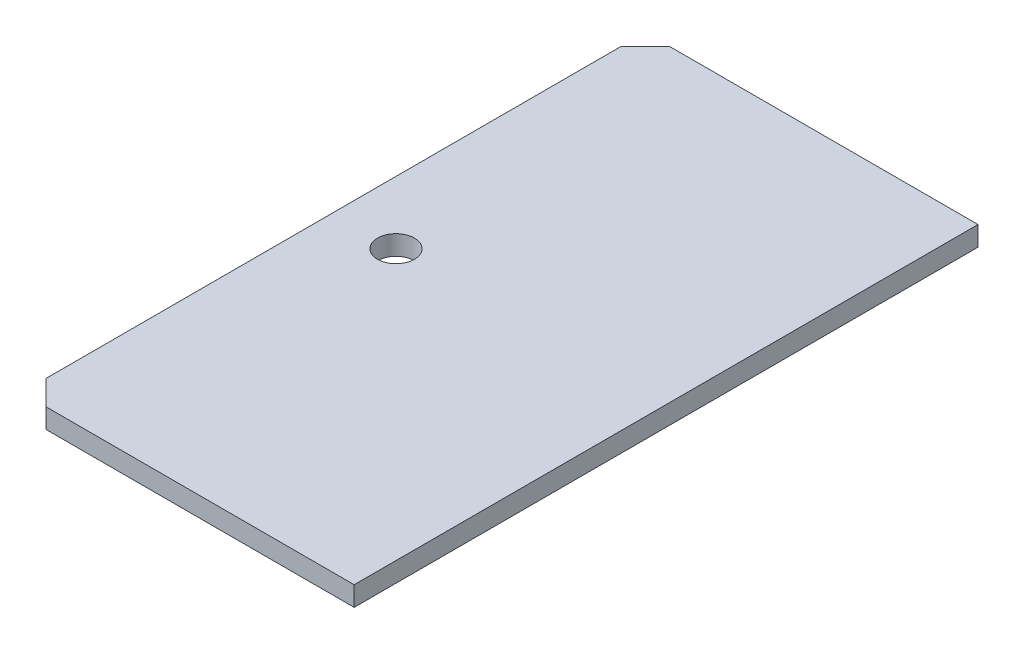
ISO-10303-21;
HEADER;
FILE_DESCRIPTION(('STEP AP214'),'2;1');
FILE_NAME('part.step','',(''),(''),'','','');
FILE_SCHEMA(('AUTOMOTIVE_DESIGN { 1 0 10303 214 1 1 1 1 }'));
ENDSEC;
DATA;
#1=APPLICATION_CONTEXT('core data for automotive mechanical design processes');
#2=APPLICATION_PROTOCOL_DEFINITION('international standard','automotive_design',2000,#1);
#3=PRODUCT_CONTEXT('',#1,'mechanical');
#4=PRODUCT('Part','Part','',(#3));
#5=PRODUCT_RELATED_PRODUCT_CATEGORY('part','',(#4));
#6=PRODUCT_DEFINITION_FORMATION('','',#4);
#7=PRODUCT_DEFINITION_CONTEXT('part definition',#1,'design');
#8=PRODUCT_DEFINITION('design','',#6,#7);
#9=PRODUCT_DEFINITION_SHAPE('','',#8);
#10=(LENGTH_UNIT() NAMED_UNIT(*) SI_UNIT(.MILLI.,.METRE.));
#11=(NAMED_UNIT(*) PLANE_ANGLE_UNIT() SI_UNIT($,.RADIAN.));
#12=(NAMED_UNIT(*) SI_UNIT($,.STERADIAN.) SOLID_ANGLE_UNIT());
#13=UNCERTAINTY_MEASURE_WITH_UNIT(LENGTH_MEASURE(1.E-05),#10,'distance_accuracy_value','');
#14=(GEOMETRIC_REPRESENTATION_CONTEXT(3) GLOBAL_UNCERTAINTY_ASSIGNED_CONTEXT((#13)) GLOBAL_UNIT_ASSIGNED_CONTEXT((#10,
#11,#12)) REPRESENTATION_CONTEXT('',''));
#15=CARTESIAN_POINT('',(0.,0.,0.));
#16=DIRECTION('',(0.,0.,1.));
#17=DIRECTION('',(1.,0.,0.));
#18=AXIS2_PLACEMENT_3D('',#15,#16,#17);
#19=CARTESIAN_POINT('',(-40.64,1.6002,-25.4));
#20=DIRECTION('',(0.,0.,1.));
#21=DIRECTION('',(1.,0.,0.));
#22=AXIS2_PLACEMENT_3D('',#19,#20,#21);
#23=PLANE('',#22);
#24=DIRECTION('',(-1.,0.,0.));
#25=VECTOR('',#24,1.);
#26=CARTESIAN_POINT('',(-40.64,1.6002,-25.4));
#27=LINE('',#26,#25);
#28=CARTESIAN_POINT('',(-13.5466666666667,1.6002,-25.4));
#29=VERTEX_POINT('',#28);
#30=CARTESIAN_POINT('',(-38.64,1.6002,-25.4));
#31=VERTEX_POINT('',#30);
#32=EDGE_CURVE('E112',#29,#31,#27,.T.);
#33=ORIENTED_EDGE('',*,*,#32,.F.);
#34=DIRECTION('',(0.,-1.,0.));
#35=VECTOR('',#34,1.);
#36=CARTESIAN_POINT('',(-13.5466666666667,10.,-25.4));
#37=LINE('',#36,#35);
#38=CARTESIAN_POINT('',(-13.5466666666667,0.,-25.4));
#39=VERTEX_POINT('',#38);
#40=EDGE_CURVE('E100',#29,#39,#37,.T.);
#41=ORIENTED_EDGE('',*,*,#40,.T.);
#42=DIRECTION('',(-1.,0.,0.));
#43=VECTOR('',#42,1.);
#44=CARTESIAN_POINT('',(-40.64,0.,-25.4));
#45=LINE('',#44,#43);
#46=CARTESIAN_POINT('',(-38.64,0.,-25.4));
#47=VERTEX_POINT('',#46);
#48=EDGE_CURVE('E110',#39,#47,#45,.T.);
#49=ORIENTED_EDGE('',*,*,#48,.T.);
#50=DIRECTION('',(0.,1.,0.));
#51=VECTOR('',#50,1.);
#52=CARTESIAN_POINT('',(-38.64,1.6002,-25.4));
#53=LINE('',#52,#51);
#54=EDGE_CURVE('E11',#47,#31,#53,.T.);
#55=ORIENTED_EDGE('',*,*,#54,.T.);
#56=EDGE_LOOP('',(#33,#41,#49,#55));
#57=FACE_BOUND('',#56,.T.);
#58=ADVANCED_FACE('F44',(#57),#23,.F.);
#59=CARTESIAN_POINT('',(-40.64,1.6002,-25.4));
#60=DIRECTION('',(1.,0.,0.));
#61=DIRECTION('',(0.,0.,-1.));
#62=AXIS2_PLACEMENT_3D('',#59,#60,#61);
#63=PLANE('',#62);
#64=DIRECTION('',(0.,0.,1.));
#65=VECTOR('',#64,1.);
#66=CARTESIAN_POINT('',(-40.64,0.,-25.4));
#67=LINE('',#66,#65);
#68=CARTESIAN_POINT('',(-40.64,0.,-23.4));
#69=VERTEX_POINT('',#68);
#70=CARTESIAN_POINT('',(-40.64,0.,23.4));
#71=VERTEX_POINT('',#70);
#72=EDGE_CURVE('E121',#69,#71,#67,.T.);
#73=ORIENTED_EDGE('',*,*,#72,.T.);
#74=DIRECTION('',(0.,1.,0.));
#75=VECTOR('',#74,1.);
#76=CARTESIAN_POINT('',(-40.64,1.6002,23.4));
#77=LINE('',#76,#75);
#78=CARTESIAN_POINT('',(-40.64,1.6002,23.4));
#79=VERTEX_POINT('',#78);
#80=EDGE_CURVE('E54',#71,#79,#77,.T.);
#81=ORIENTED_EDGE('',*,*,#80,.T.);
#82=DIRECTION('',(0.,0.,1.));
#83=VECTOR('',#82,1.);
#84=CARTESIAN_POINT('',(-40.64,1.6002,-25.4));
#85=LINE('',#84,#83);
#86=CARTESIAN_POINT('',(-40.64,1.6002,-23.4));
#87=VERTEX_POINT('',#86);
#88=EDGE_CURVE('E159',#87,#79,#85,.T.);
#89=ORIENTED_EDGE('',*,*,#88,.F.);
#90=DIRECTION('',(0.,-1.,0.));
#91=VECTOR('',#90,1.);
#92=CARTESIAN_POINT('',(-40.64,1.6002,-23.4));
#93=LINE('',#92,#91);
#94=EDGE_CURVE('E152',#87,#69,#93,.T.);
#95=ORIENTED_EDGE('',*,*,#94,.T.);
#96=EDGE_LOOP('',(#73,#81,#89,#95));
#97=FACE_BOUND('',#96,.T.);
#98=ADVANCED_FACE('F179',(#97),#63,.F.);
#99=CARTESIAN_POINT('',(-40.64,1.6002,25.4));
#100=DIRECTION('',(0.,0.,-1.));
#101=DIRECTION('',(-1.,0.,0.));
#102=AXIS2_PLACEMENT_3D('',#99,#100,#101);
#103=PLANE('',#102);
#104=DIRECTION('',(1.,0.,0.));
#105=VECTOR('',#104,1.);
#106=CARTESIAN_POINT('',(-40.64,0.,25.4));
#107=LINE('',#106,#105);
#108=CARTESIAN_POINT('',(-38.64,0.,25.4));
#109=VERTEX_POINT('',#108);
#110=CARTESIAN_POINT('',(-13.5466666666667,0.,25.4));
#111=VERTEX_POINT('',#110);
#112=EDGE_CURVE('E126',#109,#111,#107,.T.);
#113=ORIENTED_EDGE('',*,*,#112,.T.);
#114=DIRECTION('',(0.,-1.,0.));
#115=VECTOR('',#114,1.);
#116=CARTESIAN_POINT('',(-13.5466666666667,10.,25.4));
#117=LINE('',#116,#115);
#118=CARTESIAN_POINT('',(-13.5466666666667,1.6002,25.4));
#119=VERTEX_POINT('',#118);
#120=EDGE_CURVE('E61',#119,#111,#117,.T.);
#121=ORIENTED_EDGE('',*,*,#120,.F.);
#122=DIRECTION('',(1.,0.,0.));
#123=VECTOR('',#122,1.);
#124=CARTESIAN_POINT('',(-40.64,1.6002,25.4));
#125=LINE('',#124,#123);
#126=CARTESIAN_POINT('',(-38.64,1.6002,25.4));
#127=VERTEX_POINT('',#126);
#128=EDGE_CURVE('E132',#127,#119,#125,.T.);
#129=ORIENTED_EDGE('',*,*,#128,.F.);
#130=DIRECTION('',(0.,-1.,0.));
#131=VECTOR('',#130,1.);
#132=CARTESIAN_POINT('',(-38.64,1.6002,25.4));
#133=LINE('',#132,#131);
#134=EDGE_CURVE('E142',#127,#109,#133,.T.);
#135=ORIENTED_EDGE('',*,*,#134,.T.);
#136=EDGE_LOOP('',(#113,#121,#129,#135));
#137=FACE_BOUND('',#136,.T.);
#138=ADVANCED_FACE('F172',(#137),#103,.F.);
#139=CARTESIAN_POINT('',(0.,1.6002,0.));
#140=DIRECTION('',(0.,1.,0.));
#141=DIRECTION('',(0.,0.,1.));
#142=AXIS2_PLACEMENT_3D('',#139,#140,#141);
#143=PLANE('',#142);
#144=DIRECTION('',(0.,0.,1.));
#145=VECTOR('',#144,1.);
#146=CARTESIAN_POINT('',(-13.5466666666667,1.6002,0.));
#147=LINE('',#146,#145);
#148=EDGE_CURVE('E114',#29,#119,#147,.T.);
#149=ORIENTED_EDGE('',*,*,#148,.F.);
#150=ORIENTED_EDGE('',*,*,#32,.T.);
#151=DIRECTION('',(0.707106781186548,0.,-0.707106781186548));
#152=VECTOR('',#151,1.);
#153=CARTESIAN_POINT('',(-32.02,1.6002,-32.02));
#154=LINE('',#153,#152);
#155=EDGE_CURVE('E146',#31,#87,#154,.F.);
#156=ORIENTED_EDGE('',*,*,#155,.T.);
#157=ORIENTED_EDGE('',*,*,#88,.T.);
#158=DIRECTION('',(-0.707106781186545,0.,-0.70710678118655));
#159=VECTOR('',#158,1.);
#160=CARTESIAN_POINT('',(-32.0200000000001,1.6002,32.0199999999999));
#161=LINE('',#160,#159);
#162=EDGE_CURVE('E149',#79,#127,#161,.F.);
#163=ORIENTED_EDGE('',*,*,#162,.T.);
#164=ORIENTED_EDGE('',*,*,#128,.T.);
#165=EDGE_LOOP('',(#149,#150,#156,#157,#163,#164));
#166=FACE_BOUND('',#165,.T.);
#167=CARTESIAN_POINT('',(-35.54,1.6002,0.));
#168=DIRECTION('',(0.,1.,0.));
#169=DIRECTION('',(0.,0.,1.));
#170=AXIS2_PLACEMENT_3D('',#167,#168,#169);
#171=CIRCLE('',#170,1.5);
#172=CARTESIAN_POINT('',(-35.54,1.6002,1.5));
#173=VERTEX_POINT('',#172);
#174=EDGE_CURVE('E129',#173,#173,#171,.T.);
#175=ORIENTED_EDGE('',*,*,#174,.F.);
#176=EDGE_LOOP('',(#175));
#177=FACE_BOUND('',#176,.T.);
#178=ADVANCED_FACE('F174',(#166,#177),#143,.T.);
#179=CARTESIAN_POINT('',(0.,0.,0.));
#180=DIRECTION('',(0.,1.,0.));
#181=DIRECTION('',(0.,0.,1.));
#182=AXIS2_PLACEMENT_3D('',#179,#180,#181);
#183=PLANE('',#182);
#184=CARTESIAN_POINT('',(-35.54,0.,0.));
#185=DIRECTION('',(0.,1.,0.));
#186=DIRECTION('',(0.,0.,1.));
#187=AXIS2_PLACEMENT_3D('',#184,#185,#186);
#188=CIRCLE('',#187,1.5);
#189=CARTESIAN_POINT('',(-35.54,0.,1.5));
#190=VERTEX_POINT('',#189);
#191=EDGE_CURVE('E122',#190,#190,#188,.T.);
#192=ORIENTED_EDGE('',*,*,#191,.T.);
#193=EDGE_LOOP('',(#192));
#194=FACE_BOUND('',#193,.T.);
#195=ORIENTED_EDGE('',*,*,#48,.F.);
#196=DIRECTION('',(0.,0.,-1.));
#197=VECTOR('',#196,1.);
#198=CARTESIAN_POINT('',(-13.5466666666667,0.,25.4));
#199=LINE('',#198,#197);
#200=EDGE_CURVE('E97',#111,#39,#199,.T.);
#201=ORIENTED_EDGE('',*,*,#200,.F.);
#202=ORIENTED_EDGE('',*,*,#112,.F.);
#203=DIRECTION('',(0.707106781186545,0.,0.70710678118655));
#204=VECTOR('',#203,1.);
#205=CARTESIAN_POINT('',(-38.64,0.,25.4));
#206=LINE('',#205,#204);
#207=EDGE_CURVE('E139',#109,#71,#206,.F.);
#208=ORIENTED_EDGE('',*,*,#207,.T.);
#209=ORIENTED_EDGE('',*,*,#72,.F.);
#210=DIRECTION('',(-0.707106781186548,0.,0.707106781186548));
#211=VECTOR('',#210,1.);
#212=CARTESIAN_POINT('',(-40.64,0.,-23.4));
#213=LINE('',#212,#211);
#214=EDGE_CURVE('E118',#69,#47,#213,.F.);
#215=ORIENTED_EDGE('',*,*,#214,.T.);
#216=EDGE_LOOP('',(#195,#201,#202,#208,#209,#215));
#217=FACE_BOUND('',#216,.T.);
#218=ADVANCED_FACE('F116',(#194,#217),#183,.F.);
#219=CARTESIAN_POINT('',(-35.54,0.,0.));
#220=DIRECTION('',(0.,1.,0.));
#221=DIRECTION('',(0.,0.,1.));
#222=AXIS2_PLACEMENT_3D('',#219,#220,#221);
#223=CYLINDRICAL_SURFACE('',#222,1.5);
#224=ORIENTED_EDGE('',*,*,#191,.F.);
#225=EDGE_LOOP('',(#224));
#226=FACE_BOUND('',#225,.T.);
#227=ORIENTED_EDGE('',*,*,#174,.T.);
#228=EDGE_LOOP('',(#227));
#229=FACE_BOUND('',#228,.T.);
#230=ADVANCED_FACE('F189',(#226,#229),#223,.F.);
#231=CARTESIAN_POINT('',(-38.64,1.6002,25.4));
#232=DIRECTION('',(0.70710678118655,0.,-0.707106781186545));
#233=DIRECTION('',(0.,-1.,0.));
#234=AXIS2_PLACEMENT_3D('',#231,#232,#233);
#235=PLANE('',#234);
#236=ORIENTED_EDGE('',*,*,#162,.F.);
#237=ORIENTED_EDGE('',*,*,#80,.F.);
#238=ORIENTED_EDGE('',*,*,#207,.F.);
#239=ORIENTED_EDGE('',*,*,#134,.F.);
#240=EDGE_LOOP('',(#236,#237,#238,#239));
#241=FACE_BOUND('',#240,.T.);
#242=ADVANCED_FACE('F178',(#241),#235,.F.);
#243=CARTESIAN_POINT('',(-40.64,1.6002,-23.4));
#244=DIRECTION('',(0.707106781186547,0.,0.707106781186547));
#245=DIRECTION('',(0.,-1.,0.));
#246=AXIS2_PLACEMENT_3D('',#243,#244,#245);
#247=PLANE('',#246);
#248=ORIENTED_EDGE('',*,*,#155,.F.);
#249=ORIENTED_EDGE('',*,*,#54,.F.);
#250=ORIENTED_EDGE('',*,*,#214,.F.);
#251=ORIENTED_EDGE('',*,*,#94,.F.);
#252=EDGE_LOOP('',(#248,#249,#250,#251));
#253=FACE_BOUND('',#252,.T.);
#254=ADVANCED_FACE('F47',(#253),#247,.F.);
#255=CARTESIAN_POINT('',(-13.5466666666667,10.,25.4));
#256=DIRECTION('',(-1.,0.,0.));
#257=DIRECTION('',(0.,0.,1.));
#258=AXIS2_PLACEMENT_3D('',#255,#256,#257);
#259=PLANE('',#258);
#260=ORIENTED_EDGE('',*,*,#148,.T.);
#261=ORIENTED_EDGE('',*,*,#120,.T.);
#262=ORIENTED_EDGE('',*,*,#200,.T.);
#263=ORIENTED_EDGE('',*,*,#40,.F.);
#264=EDGE_LOOP('',(#260,#261,#262,#263));
#265=FACE_BOUND('',#264,.T.);
#266=ADVANCED_FACE('F99',(#265),#259,.F.);
#267=CLOSED_SHELL('',(#58,#98,#138,#178,#218,#230,#242,#254,#266));
#268=MANIFOLD_SOLID_BREP('B2',#267);
#269=ADVANCED_BREP_SHAPE_REPRESENTATION('',(#18,#268),#14);
#270=SHAPE_DEFINITION_REPRESENTATION(#9,#269);
ENDSEC;
END-ISO-10303-21;
